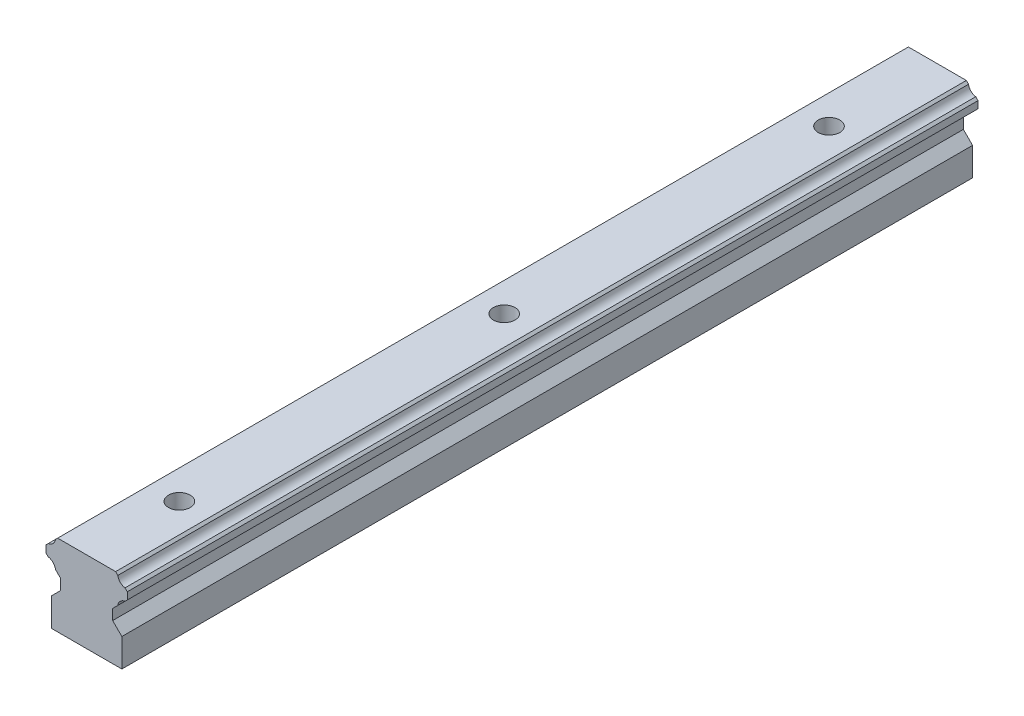
ISO-10303-21;
HEADER;
FILE_DESCRIPTION(('STEP AP214'),'2;1');
FILE_NAME('part.step','',(''),(''),'','','');
FILE_SCHEMA(('AUTOMOTIVE_DESIGN { 1 0 10303 214 1 1 1 1 }'));
ENDSEC;
DATA;
#1=APPLICATION_CONTEXT('core data for automotive mechanical design processes');
#2=APPLICATION_PROTOCOL_DEFINITION('international standard','automotive_design',2000,#1);
#3=PRODUCT_CONTEXT('',#1,'mechanical');
#4=PRODUCT('Part','Part','',(#3));
#5=PRODUCT_RELATED_PRODUCT_CATEGORY('part','',(#4));
#6=PRODUCT_DEFINITION_FORMATION('','',#4);
#7=PRODUCT_DEFINITION_CONTEXT('part definition',#1,'design');
#8=PRODUCT_DEFINITION('design','',#6,#7);
#9=PRODUCT_DEFINITION_SHAPE('','',#8);
#10=(LENGTH_UNIT() NAMED_UNIT(*) SI_UNIT(.MILLI.,.METRE.));
#11=(NAMED_UNIT(*) PLANE_ANGLE_UNIT() SI_UNIT($,.RADIAN.));
#12=(NAMED_UNIT(*) SI_UNIT($,.STERADIAN.) SOLID_ANGLE_UNIT());
#13=UNCERTAINTY_MEASURE_WITH_UNIT(LENGTH_MEASURE(1.E-05),#10,'distance_accuracy_value','');
#14=(GEOMETRIC_REPRESENTATION_CONTEXT(3) GLOBAL_UNCERTAINTY_ASSIGNED_CONTEXT((#13)) GLOBAL_UNIT_ASSIGNED_CONTEXT((#10,
#11,#12)) REPRESENTATION_CONTEXT('',''));
#15=CARTESIAN_POINT('',(0.,0.,0.));
#16=DIRECTION('',(0.,0.,1.));
#17=DIRECTION('',(1.,0.,0.));
#18=AXIS2_PLACEMENT_3D('',#15,#16,#17);
#19=CARTESIAN_POINT('',(-6.5,5.20000000000005,156.99994));
#20=DIRECTION('',(0.707106781186547,-0.707106781186547,0.));
#21=DIRECTION('',(0.707106781186548,0.707106781186548,0.));
#22=AXIS2_PLACEMENT_3D('',#19,#20,#21);
#23=PLANE('',#22);
#24=DIRECTION('',(-0.707106781186547,-0.707106781186547,0.));
#25=VECTOR('',#24,1.);
#26=CARTESIAN_POINT('',(-6.5,5.20000000000005,0.));
#27=LINE('',#26,#25);
#28=CARTESIAN_POINT('',(-4.8,6.90000000000005,0.));
#29=VERTEX_POINT('',#28);
#30=CARTESIAN_POINT('',(-6.5,5.20000000000005,0.));
#31=VERTEX_POINT('',#30);
#32=EDGE_CURVE('E214',#29,#31,#27,.T.);
#33=ORIENTED_EDGE('',*,*,#32,.T.);
#34=DIRECTION('',(0.,0.,-1.));
#35=VECTOR('',#34,1.);
#36=CARTESIAN_POINT('',(-6.5,5.20000000000005,156.99994));
#37=LINE('',#36,#35);
#38=CARTESIAN_POINT('',(-6.5,5.20000000000005,156.99994));
#39=VERTEX_POINT('',#38);
#40=EDGE_CURVE('E11',#39,#31,#37,.T.);
#41=ORIENTED_EDGE('',*,*,#40,.F.);
#42=DIRECTION('',(-0.707106781186547,-0.707106781186547,0.));
#43=VECTOR('',#42,1.);
#44=CARTESIAN_POINT('',(-6.5,5.20000000000005,156.99994));
#45=LINE('',#44,#43);
#46=CARTESIAN_POINT('',(-4.8,6.90000000000005,156.99994));
#47=VERTEX_POINT('',#46);
#48=EDGE_CURVE('E257',#47,#39,#45,.T.);
#49=ORIENTED_EDGE('',*,*,#48,.F.);
#50=DIRECTION('',(0.,0.,-1.));
#51=VECTOR('',#50,1.);
#52=CARTESIAN_POINT('',(-4.8,6.90000000000005,156.99994));
#53=LINE('',#52,#51);
#54=EDGE_CURVE('E210',#47,#29,#53,.T.);
#55=ORIENTED_EDGE('',*,*,#54,.T.);
#56=EDGE_LOOP('',(#33,#41,#49,#55));
#57=FACE_BOUND('',#56,.T.);
#58=ADVANCED_FACE('F34',(#57),#23,.F.);
#59=CARTESIAN_POINT('',(-6.5,5.20000000000005,156.99994));
#60=DIRECTION('',(1.,0.,0.));
#61=DIRECTION('',(0.,0.,-1.));
#62=AXIS2_PLACEMENT_3D('',#59,#60,#61);
#63=PLANE('',#62);
#64=DIRECTION('',(0.,-1.,0.));
#65=VECTOR('',#64,1.);
#66=CARTESIAN_POINT('',(-6.5,5.20000000000005,0.));
#67=LINE('',#66,#65);
#68=CARTESIAN_POINT('',(-6.5,0.,0.));
#69=VERTEX_POINT('',#68);
#70=EDGE_CURVE('E217',#31,#69,#67,.T.);
#71=ORIENTED_EDGE('',*,*,#70,.T.);
#72=DIRECTION('',(0.,0.,-1.));
#73=VECTOR('',#72,1.);
#74=CARTESIAN_POINT('',(-6.5,0.,156.99994));
#75=LINE('',#74,#73);
#76=CARTESIAN_POINT('',(-6.5,0.,156.99994));
#77=VERTEX_POINT('',#76);
#78=EDGE_CURVE('E42',#77,#69,#75,.T.);
#79=ORIENTED_EDGE('',*,*,#78,.F.);
#80=DIRECTION('',(0.,-1.,0.));
#81=VECTOR('',#80,1.);
#82=CARTESIAN_POINT('',(-6.5,5.20000000000005,156.99994));
#83=LINE('',#82,#81);
#84=EDGE_CURVE('E135',#39,#77,#83,.T.);
#85=ORIENTED_EDGE('',*,*,#84,.F.);
#86=ORIENTED_EDGE('',*,*,#40,.T.);
#87=EDGE_LOOP('',(#71,#79,#85,#86));
#88=FACE_BOUND('',#87,.T.);
#89=ADVANCED_FACE('F385',(#88),#63,.F.);
#90=CARTESIAN_POINT('',(-6.5,0.,156.99994));
#91=DIRECTION('',(0.,1.,0.));
#92=DIRECTION('',(0.,0.,1.));
#93=AXIS2_PLACEMENT_3D('',#90,#91,#92);
#94=PLANE('',#93);
#95=CARTESIAN_POINT('',(0.,0.,20.));
#96=DIRECTION('',(0.,1.,0.));
#97=DIRECTION('',(0.,0.,1.));
#98=AXIS2_PLACEMENT_3D('',#95,#96,#97);
#99=CIRCLE('',#98,2.);
#100=CARTESIAN_POINT('',(0.,0.,22.));
#101=VERTEX_POINT('',#100);
#102=EDGE_CURVE('E218',#101,#101,#99,.T.);
#103=ORIENTED_EDGE('',*,*,#102,.T.);
#104=EDGE_LOOP('',(#103));
#105=FACE_BOUND('',#104,.T.);
#106=CARTESIAN_POINT('',(0.,0.,79.944));
#107=DIRECTION('',(0.,1.,0.));
#108=DIRECTION('',(0.,0.,1.));
#109=AXIS2_PLACEMENT_3D('',#106,#107,#108);
#110=CIRCLE('',#109,2.);
#111=CARTESIAN_POINT('',(0.,0.,81.944));
#112=VERTEX_POINT('',#111);
#113=EDGE_CURVE('E533',#112,#112,#110,.T.);
#114=ORIENTED_EDGE('',*,*,#113,.T.);
#115=EDGE_LOOP('',(#114));
#116=FACE_BOUND('',#115,.T.);
#117=CARTESIAN_POINT('',(0.,0.,139.888));
#118=DIRECTION('',(0.,1.,0.));
#119=DIRECTION('',(0.,0.,1.));
#120=AXIS2_PLACEMENT_3D('',#117,#118,#119);
#121=CIRCLE('',#120,2.);
#122=CARTESIAN_POINT('',(0.,0.,141.888));
#123=VERTEX_POINT('',#122);
#124=EDGE_CURVE('E542',#123,#123,#121,.T.);
#125=ORIENTED_EDGE('',*,*,#124,.T.);
#126=EDGE_LOOP('',(#125));
#127=FACE_BOUND('',#126,.T.);
#128=DIRECTION('',(1.,0.,0.));
#129=VECTOR('',#128,1.);
#130=CARTESIAN_POINT('',(-6.5,0.,0.));
#131=LINE('',#130,#129);
#132=CARTESIAN_POINT('',(6.5,0.,0.));
#133=VERTEX_POINT('',#132);
#134=EDGE_CURVE('E220',#69,#133,#131,.T.);
#135=ORIENTED_EDGE('',*,*,#134,.T.);
#136=DIRECTION('',(0.,0.,-1.));
#137=VECTOR('',#136,1.);
#138=CARTESIAN_POINT('',(6.5,0.,156.99994));
#139=LINE('',#138,#137);
#140=CARTESIAN_POINT('',(6.5,0.,156.99994));
#141=VERTEX_POINT('',#140);
#142=EDGE_CURVE('E306',#141,#133,#139,.T.);
#143=ORIENTED_EDGE('',*,*,#142,.F.);
#144=DIRECTION('',(1.,0.,0.));
#145=VECTOR('',#144,1.);
#146=CARTESIAN_POINT('',(-6.5,0.,156.99994));
#147=LINE('',#146,#145);
#148=EDGE_CURVE('E314',#77,#141,#147,.T.);
#149=ORIENTED_EDGE('',*,*,#148,.F.);
#150=ORIENTED_EDGE('',*,*,#78,.T.);
#151=EDGE_LOOP('',(#135,#143,#149,#150));
#152=FACE_BOUND('',#151,.T.);
#153=ADVANCED_FACE('F312',(#105,#116,#127,#152),#94,.F.);
#154=CARTESIAN_POINT('',(6.5,5.20000000000005,156.99994));
#155=DIRECTION('',(-1.,0.,0.));
#156=DIRECTION('',(0.,0.,1.));
#157=AXIS2_PLACEMENT_3D('',#154,#155,#156);
#158=PLANE('',#157);
#159=DIRECTION('',(0.,1.,0.));
#160=VECTOR('',#159,1.);
#161=CARTESIAN_POINT('',(6.5,5.20000000000005,0.));
#162=LINE('',#161,#160);
#163=CARTESIAN_POINT('',(6.5,5.20000000000005,0.));
#164=VERTEX_POINT('',#163);
#165=EDGE_CURVE('E222',#133,#164,#162,.T.);
#166=ORIENTED_EDGE('',*,*,#165,.T.);
#167=DIRECTION('',(0.,0.,-1.));
#168=VECTOR('',#167,1.);
#169=CARTESIAN_POINT('',(6.5,5.20000000000005,156.99994));
#170=LINE('',#169,#168);
#171=CARTESIAN_POINT('',(6.5,5.20000000000005,156.99994));
#172=VERTEX_POINT('',#171);
#173=EDGE_CURVE('E303',#172,#164,#170,.T.);
#174=ORIENTED_EDGE('',*,*,#173,.F.);
#175=DIRECTION('',(0.,1.,0.));
#176=VECTOR('',#175,1.);
#177=CARTESIAN_POINT('',(6.5,5.20000000000005,156.99994));
#178=LINE('',#177,#176);
#179=EDGE_CURVE('E332',#141,#172,#178,.T.);
#180=ORIENTED_EDGE('',*,*,#179,.F.);
#181=ORIENTED_EDGE('',*,*,#142,.T.);
#182=EDGE_LOOP('',(#166,#174,#180,#181));
#183=FACE_BOUND('',#182,.T.);
#184=ADVANCED_FACE('F323',(#183),#158,.F.);
#185=CARTESIAN_POINT('',(4.8,6.90000000000005,156.99994));
#186=DIRECTION('',(-0.707106781186547,-0.707106781186547,0.));
#187=DIRECTION('',(0.707106781186548,-0.707106781186548,0.));
#188=AXIS2_PLACEMENT_3D('',#185,#186,#187);
#189=PLANE('',#188);
#190=DIRECTION('',(-0.707106781186547,0.707106781186547,0.));
#191=VECTOR('',#190,1.);
#192=CARTESIAN_POINT('',(4.8,6.90000000000005,0.));
#193=LINE('',#192,#191);
#194=CARTESIAN_POINT('',(4.8,6.90000000000005,0.));
#195=VERTEX_POINT('',#194);
#196=EDGE_CURVE('E224',#164,#195,#193,.T.);
#197=ORIENTED_EDGE('',*,*,#196,.T.);
#198=DIRECTION('',(0.,0.,-1.));
#199=VECTOR('',#198,1.);
#200=CARTESIAN_POINT('',(4.8,6.90000000000005,156.99994));
#201=LINE('',#200,#199);
#202=CARTESIAN_POINT('',(4.8,6.90000000000005,156.99994));
#203=VERTEX_POINT('',#202);
#204=EDGE_CURVE('E300',#203,#195,#201,.T.);
#205=ORIENTED_EDGE('',*,*,#204,.F.);
#206=DIRECTION('',(-0.707106781186547,0.707106781186547,0.));
#207=VECTOR('',#206,1.);
#208=CARTESIAN_POINT('',(4.8,6.90000000000005,156.99994));
#209=LINE('',#208,#207);
#210=EDGE_CURVE('E329',#172,#203,#209,.T.);
#211=ORIENTED_EDGE('',*,*,#210,.F.);
#212=ORIENTED_EDGE('',*,*,#173,.T.);
#213=EDGE_LOOP('',(#197,#205,#211,#212));
#214=FACE_BOUND('',#213,.T.);
#215=ADVANCED_FACE('F327',(#214),#189,.F.);
#216=CARTESIAN_POINT('',(4.8,8.84000000000005,156.99994));
#217=DIRECTION('',(-1.,0.,0.));
#218=DIRECTION('',(0.,0.,1.));
#219=AXIS2_PLACEMENT_3D('',#216,#217,#218);
#220=PLANE('',#219);
#221=DIRECTION('',(0.,1.,0.));
#222=VECTOR('',#221,1.);
#223=CARTESIAN_POINT('',(4.8,8.84000000000005,0.));
#224=LINE('',#223,#222);
#225=CARTESIAN_POINT('',(4.8,8.84000000000005,0.));
#226=VERTEX_POINT('',#225);
#227=EDGE_CURVE('E226',#195,#226,#224,.T.);
#228=ORIENTED_EDGE('',*,*,#227,.T.);
#229=DIRECTION('',(0.,0.,-1.));
#230=VECTOR('',#229,1.);
#231=CARTESIAN_POINT('',(4.8,8.84000000000005,156.99994));
#232=LINE('',#231,#230);
#233=CARTESIAN_POINT('',(4.8,8.84000000000005,156.99994));
#234=VERTEX_POINT('',#233);
#235=EDGE_CURVE('E297',#234,#226,#232,.T.);
#236=ORIENTED_EDGE('',*,*,#235,.F.);
#237=DIRECTION('',(0.,1.,0.));
#238=VECTOR('',#237,1.);
#239=CARTESIAN_POINT('',(4.8,8.84000000000005,156.99994));
#240=LINE('',#239,#238);
#241=EDGE_CURVE('E331',#203,#234,#240,.T.);
#242=ORIENTED_EDGE('',*,*,#241,.F.);
#243=ORIENTED_EDGE('',*,*,#204,.T.);
#244=EDGE_LOOP('',(#228,#236,#242,#243));
#245=FACE_BOUND('',#244,.T.);
#246=ADVANCED_FACE('F399',(#245),#220,.F.);
#247=CARTESIAN_POINT('',(5.7548684340674,9.79486843406745,156.99994));
#248=DIRECTION('',(-0.707106781186548,0.707106781186547,0.));
#249=DIRECTION('',(-0.707106781186547,-0.707106781186548,0.));
#250=AXIS2_PLACEMENT_3D('',#247,#248,#249);
#251=PLANE('',#250);
#252=DIRECTION('',(0.707106781186547,0.707106781186548,0.));
#253=VECTOR('',#252,1.);
#254=CARTESIAN_POINT('',(5.7548684340674,9.79486843406745,0.));
#255=LINE('',#254,#253);
#256=CARTESIAN_POINT('',(5.7548684340674,9.79486843406745,0.));
#257=VERTEX_POINT('',#256);
#258=EDGE_CURVE('E228',#226,#257,#255,.T.);
#259=ORIENTED_EDGE('',*,*,#258,.T.);
#260=DIRECTION('',(0.,0.,-1.));
#261=VECTOR('',#260,1.);
#262=CARTESIAN_POINT('',(5.7548684340674,9.79486843406745,156.99994));
#263=LINE('',#262,#261);
#264=CARTESIAN_POINT('',(5.7548684340674,9.79486843406745,156.99994));
#265=VERTEX_POINT('',#264);
#266=EDGE_CURVE('E294',#265,#257,#263,.T.);
#267=ORIENTED_EDGE('',*,*,#266,.F.);
#268=DIRECTION('',(0.707106781186547,0.707106781186548,0.));
#269=VECTOR('',#268,1.);
#270=CARTESIAN_POINT('',(5.7548684340674,9.79486843406745,156.99994));
#271=LINE('',#270,#269);
#272=EDGE_CURVE('E334',#234,#265,#271,.T.);
#273=ORIENTED_EDGE('',*,*,#272,.F.);
#274=ORIENTED_EDGE('',*,*,#235,.T.);
#275=EDGE_LOOP('',(#259,#267,#273,#274));
#276=FACE_BOUND('',#275,.T.);
#277=ADVANCED_FACE('F402',(#276),#251,.F.);
#278=CARTESIAN_POINT('',(7.29999999999997,9.58000000000008,156.99994));
#279=DIRECTION('',(0.,0.,-1.));
#280=DIRECTION('',(-1.,0.,0.));
#281=AXIS2_PLACEMENT_3D('',#278,#279,#280);
#282=CYLINDRICAL_SURFACE('',#281,1.55999999999993);
#283=CARTESIAN_POINT('',(7.29999999999997,9.58000000000008,0.));
#284=DIRECTION('',(0.,0.,-1.));
#285=DIRECTION('',(1.,0.,0.));
#286=AXIS2_PLACEMENT_3D('',#283,#284,#285);
#287=CIRCLE('',#286,1.55999999999993);
#288=CARTESIAN_POINT('',(7.0851315659326,11.1251315659326,0.));
#289=VERTEX_POINT('',#288);
#290=EDGE_CURVE('E230',#257,#289,#287,.T.);
#291=ORIENTED_EDGE('',*,*,#290,.T.);
#292=DIRECTION('',(0.,0.,-1.));
#293=VECTOR('',#292,1.);
#294=CARTESIAN_POINT('',(7.0851315659326,11.1251315659326,156.99994));
#295=LINE('',#294,#293);
#296=CARTESIAN_POINT('',(7.0851315659326,11.1251315659326,156.99994));
#297=VERTEX_POINT('',#296);
#298=EDGE_CURVE('E291',#297,#289,#295,.T.);
#299=ORIENTED_EDGE('',*,*,#298,.F.);
#300=CARTESIAN_POINT('',(7.29999999999997,9.58000000000008,156.99994));
#301=DIRECTION('',(0.,0.,-1.));
#302=DIRECTION('',(1.,0.,0.));
#303=AXIS2_PLACEMENT_3D('',#300,#301,#302);
#304=CIRCLE('',#303,1.55999999999993);
#305=EDGE_CURVE('E340',#265,#297,#304,.T.);
#306=ORIENTED_EDGE('',*,*,#305,.F.);
#307=ORIENTED_EDGE('',*,*,#266,.T.);
#308=EDGE_LOOP('',(#291,#299,#306,#307));
#309=FACE_BOUND('',#308,.T.);
#310=ADVANCED_FACE('F406',(#309),#282,.F.);
#311=CARTESIAN_POINT('',(7.5,11.54,156.99994));
#312=DIRECTION('',(-0.707106781186548,0.707106781186547,0.));
#313=DIRECTION('',(-0.707106781186547,-0.707106781186548,0.));
#314=AXIS2_PLACEMENT_3D('',#311,#312,#313);
#315=PLANE('',#314);
#316=DIRECTION('',(0.707106781186547,0.707106781186548,0.));
#317=VECTOR('',#316,1.);
#318=CARTESIAN_POINT('',(7.5,11.54,0.));
#319=LINE('',#318,#317);
#320=CARTESIAN_POINT('',(7.5,11.54,0.));
#321=VERTEX_POINT('',#320);
#322=EDGE_CURVE('E232',#289,#321,#319,.T.);
#323=ORIENTED_EDGE('',*,*,#322,.T.);
#324=DIRECTION('',(0.,0.,-1.));
#325=VECTOR('',#324,1.);
#326=CARTESIAN_POINT('',(7.5,11.54,156.99994));
#327=LINE('',#326,#325);
#328=CARTESIAN_POINT('',(7.5,11.54,156.99994));
#329=VERTEX_POINT('',#328);
#330=EDGE_CURVE('E288',#329,#321,#327,.T.);
#331=ORIENTED_EDGE('',*,*,#330,.F.);
#332=DIRECTION('',(0.707106781186547,0.707106781186548,0.));
#333=VECTOR('',#332,1.);
#334=CARTESIAN_POINT('',(7.5,11.54,156.99994));
#335=LINE('',#334,#333);
#336=EDGE_CURVE('E342',#297,#329,#335,.T.);
#337=ORIENTED_EDGE('',*,*,#336,.F.);
#338=ORIENTED_EDGE('',*,*,#298,.T.);
#339=EDGE_LOOP('',(#323,#331,#337,#338));
#340=FACE_BOUND('',#339,.T.);
#341=ADVANCED_FACE('F410',(#340),#315,.F.);
#342=CARTESIAN_POINT('',(7.5,12.85,156.99994));
#343=DIRECTION('',(-1.,0.,0.));
#344=DIRECTION('',(0.,0.,1.));
#345=AXIS2_PLACEMENT_3D('',#342,#343,#344);
#346=PLANE('',#345);
#347=DIRECTION('',(0.,1.,0.));
#348=VECTOR('',#347,1.);
#349=CARTESIAN_POINT('',(7.5,12.85,0.));
#350=LINE('',#349,#348);
#351=CARTESIAN_POINT('',(7.5,12.85,0.));
#352=VERTEX_POINT('',#351);
#353=EDGE_CURVE('E234',#321,#352,#350,.T.);
#354=ORIENTED_EDGE('',*,*,#353,.T.);
#355=DIRECTION('',(0.,0.,-1.));
#356=VECTOR('',#355,1.);
#357=CARTESIAN_POINT('',(7.5,12.85,156.99994));
#358=LINE('',#357,#356);
#359=CARTESIAN_POINT('',(7.5,12.85,156.99994));
#360=VERTEX_POINT('',#359);
#361=EDGE_CURVE('E285',#360,#352,#358,.T.);
#362=ORIENTED_EDGE('',*,*,#361,.F.);
#363=DIRECTION('',(0.,1.,0.));
#364=VECTOR('',#363,1.);
#365=CARTESIAN_POINT('',(7.5,12.85,156.99994));
#366=LINE('',#365,#364);
#367=EDGE_CURVE('E344',#329,#360,#366,.T.);
#368=ORIENTED_EDGE('',*,*,#367,.F.);
#369=ORIENTED_EDGE('',*,*,#330,.T.);
#370=EDGE_LOOP('',(#354,#362,#368,#369));
#371=FACE_BOUND('',#370,.T.);
#372=ADVANCED_FACE('F414',(#371),#346,.F.);
#373=CARTESIAN_POINT('',(7.0816423301223,13.2683576698777,156.99994));
#374=DIRECTION('',(-0.707106781186549,-0.707106781186546,0.));
#375=DIRECTION('',(0.707106781186546,-0.707106781186549,0.));
#376=AXIS2_PLACEMENT_3D('',#373,#374,#375);
#377=PLANE('',#376);
#378=DIRECTION('',(-0.707106781186546,0.707106781186549,0.));
#379=VECTOR('',#378,1.);
#380=CARTESIAN_POINT('',(7.0816423301223,13.2683576698777,0.));
#381=LINE('',#380,#379);
#382=CARTESIAN_POINT('',(7.0816423301223,13.2683576698777,0.));
#383=VERTEX_POINT('',#382);
#384=EDGE_CURVE('E236',#352,#383,#381,.T.);
#385=ORIENTED_EDGE('',*,*,#384,.T.);
#386=DIRECTION('',(0.,0.,-1.));
#387=VECTOR('',#386,1.);
#388=CARTESIAN_POINT('',(7.0816423301223,13.2683576698777,156.99994));
#389=LINE('',#388,#387);
#390=CARTESIAN_POINT('',(7.0816423301223,13.2683576698777,156.99994));
#391=VERTEX_POINT('',#390);
#392=EDGE_CURVE('E282',#391,#383,#389,.T.);
#393=ORIENTED_EDGE('',*,*,#392,.F.);
#394=DIRECTION('',(-0.707106781186546,0.707106781186549,0.));
#395=VECTOR('',#394,1.);
#396=CARTESIAN_POINT('',(7.0816423301223,13.2683576698777,156.99994));
#397=LINE('',#396,#395);
#398=EDGE_CURVE('E346',#360,#391,#397,.T.);
#399=ORIENTED_EDGE('',*,*,#398,.F.);
#400=ORIENTED_EDGE('',*,*,#361,.T.);
#401=EDGE_LOOP('',(#385,#393,#399,#400));
#402=FACE_BOUND('',#401,.T.);
#403=ADVANCED_FACE('F418',(#402),#377,.F.);
#404=CARTESIAN_POINT('',(7.30000000000014,14.8130000000002,156.99994));
#405=DIRECTION('',(0.,0.,-1.));
#406=DIRECTION('',(-1.,0.,0.));
#407=AXIS2_PLACEMENT_3D('',#404,#405,#406);
#408=CYLINDRICAL_SURFACE('',#407,1.56000000000018);
#409=CARTESIAN_POINT('',(7.30000000000014,14.8130000000002,0.));
#410=DIRECTION('',(0.,0.,-1.));
#411=DIRECTION('',(1.,0.,0.));
#412=AXIS2_PLACEMENT_3D('',#409,#410,#411);
#413=CIRCLE('',#412,1.56000000000018);
#414=CARTESIAN_POINT('',(5.7553576698777,14.5946423301223,0.));
#415=VERTEX_POINT('',#414);
#416=EDGE_CURVE('E238',#383,#415,#413,.T.);
#417=ORIENTED_EDGE('',*,*,#416,.T.);
#418=DIRECTION('',(0.,0.,-1.));
#419=VECTOR('',#418,1.);
#420=CARTESIAN_POINT('',(5.7553576698777,14.5946423301223,156.99994));
#421=LINE('',#420,#419);
#422=CARTESIAN_POINT('',(5.7553576698777,14.5946423301223,156.99994));
#423=VERTEX_POINT('',#422);
#424=EDGE_CURVE('E279',#423,#415,#421,.T.);
#425=ORIENTED_EDGE('',*,*,#424,.F.);
#426=CARTESIAN_POINT('',(7.30000000000014,14.8130000000002,156.99994));
#427=DIRECTION('',(0.,0.,-1.));
#428=DIRECTION('',(1.,0.,0.));
#429=AXIS2_PLACEMENT_3D('',#426,#427,#428);
#430=CIRCLE('',#429,1.56000000000018);
#431=EDGE_CURVE('E348',#391,#423,#430,.T.);
#432=ORIENTED_EDGE('',*,*,#431,.F.);
#433=ORIENTED_EDGE('',*,*,#392,.T.);
#434=EDGE_LOOP('',(#417,#425,#432,#433));
#435=FACE_BOUND('',#434,.T.);
#436=ADVANCED_FACE('F422',(#435),#408,.F.);
#437=CARTESIAN_POINT('',(5.35,15.,156.99994));
#438=DIRECTION('',(-0.707106781186549,-0.707106781186546,0.));
#439=DIRECTION('',(0.707106781186546,-0.707106781186549,0.));
#440=AXIS2_PLACEMENT_3D('',#437,#438,#439);
#441=PLANE('',#440);
#442=DIRECTION('',(-0.707106781186546,0.707106781186549,0.));
#443=VECTOR('',#442,1.);
#444=CARTESIAN_POINT('',(5.35,15.,0.));
#445=LINE('',#444,#443);
#446=CARTESIAN_POINT('',(5.35,15.,0.));
#447=VERTEX_POINT('',#446);
#448=EDGE_CURVE('E240',#415,#447,#445,.T.);
#449=ORIENTED_EDGE('',*,*,#448,.T.);
#450=DIRECTION('',(0.,0.,-1.));
#451=VECTOR('',#450,1.);
#452=CARTESIAN_POINT('',(5.35,15.,156.99994));
#453=LINE('',#452,#451);
#454=CARTESIAN_POINT('',(5.35,15.,156.99994));
#455=VERTEX_POINT('',#454);
#456=EDGE_CURVE('E276',#455,#447,#453,.T.);
#457=ORIENTED_EDGE('',*,*,#456,.F.);
#458=DIRECTION('',(-0.707106781186546,0.707106781186549,0.));
#459=VECTOR('',#458,1.);
#460=CARTESIAN_POINT('',(5.35,15.,156.99994));
#461=LINE('',#460,#459);
#462=EDGE_CURVE('E350',#423,#455,#461,.T.);
#463=ORIENTED_EDGE('',*,*,#462,.F.);
#464=ORIENTED_EDGE('',*,*,#424,.T.);
#465=EDGE_LOOP('',(#449,#457,#463,#464));
#466=FACE_BOUND('',#465,.T.);
#467=ADVANCED_FACE('F426',(#466),#441,.F.);
#468=CARTESIAN_POINT('',(-5.35,15.,156.99994));
#469=DIRECTION('',(0.,-1.,0.));
#470=DIRECTION('',(0.,0.,-1.));
#471=AXIS2_PLACEMENT_3D('',#468,#469,#470);
#472=PLANE('',#471);
#473=CARTESIAN_POINT('',(0.,15.,20.));
#474=DIRECTION('',(0.,1.,0.));
#475=DIRECTION('',(0.,0.,1.));
#476=AXIS2_PLACEMENT_3D('',#473,#474,#475);
#477=CIRCLE('',#476,2.);
#478=CARTESIAN_POINT('',(0.,15.,22.));
#479=VERTEX_POINT('',#478);
#480=EDGE_CURVE('E532',#479,#479,#477,.T.);
#481=ORIENTED_EDGE('',*,*,#480,.F.);
#482=EDGE_LOOP('',(#481));
#483=FACE_BOUND('',#482,.T.);
#484=CARTESIAN_POINT('',(0.,15.,79.944));
#485=DIRECTION('',(0.,1.,0.));
#486=DIRECTION('',(0.,0.,1.));
#487=AXIS2_PLACEMENT_3D('',#484,#485,#486);
#488=CIRCLE('',#487,2.);
#489=CARTESIAN_POINT('',(0.,15.,81.944));
#490=VERTEX_POINT('',#489);
#491=EDGE_CURVE('E537',#490,#490,#488,.T.);
#492=ORIENTED_EDGE('',*,*,#491,.F.);
#493=EDGE_LOOP('',(#492));
#494=FACE_BOUND('',#493,.T.);
#495=CARTESIAN_POINT('',(0.,15.,139.888));
#496=DIRECTION('',(0.,1.,0.));
#497=DIRECTION('',(0.,0.,1.));
#498=AXIS2_PLACEMENT_3D('',#495,#496,#497);
#499=CIRCLE('',#498,2.);
#500=CARTESIAN_POINT('',(0.,15.,141.888));
#501=VERTEX_POINT('',#500);
#502=EDGE_CURVE('E545',#501,#501,#499,.T.);
#503=ORIENTED_EDGE('',*,*,#502,.F.);
#504=EDGE_LOOP('',(#503));
#505=FACE_BOUND('',#504,.T.);
#506=DIRECTION('',(-1.,0.,0.));
#507=VECTOR('',#506,1.);
#508=CARTESIAN_POINT('',(-5.35,15.,0.));
#509=LINE('',#508,#507);
#510=CARTESIAN_POINT('',(-5.35,15.,0.));
#511=VERTEX_POINT('',#510);
#512=EDGE_CURVE('E242',#447,#511,#509,.T.);
#513=ORIENTED_EDGE('',*,*,#512,.T.);
#514=DIRECTION('',(0.,0.,-1.));
#515=VECTOR('',#514,1.);
#516=CARTESIAN_POINT('',(-5.35,15.,156.99994));
#517=LINE('',#516,#515);
#518=CARTESIAN_POINT('',(-5.35,15.,156.99994));
#519=VERTEX_POINT('',#518);
#520=EDGE_CURVE('E273',#519,#511,#517,.T.);
#521=ORIENTED_EDGE('',*,*,#520,.F.);
#522=DIRECTION('',(-1.,0.,0.));
#523=VECTOR('',#522,1.);
#524=CARTESIAN_POINT('',(-5.35,15.,156.99994));
#525=LINE('',#524,#523);
#526=EDGE_CURVE('E352',#455,#519,#525,.T.);
#527=ORIENTED_EDGE('',*,*,#526,.F.);
#528=ORIENTED_EDGE('',*,*,#456,.T.);
#529=EDGE_LOOP('',(#513,#521,#527,#528));
#530=FACE_BOUND('',#529,.T.);
#531=ADVANCED_FACE('F430',(#483,#494,#505,#530),#472,.F.);
#532=CARTESIAN_POINT('',(-5.7553576698777,14.5946423301223,156.99994));
#533=DIRECTION('',(0.707106781186547,-0.707106781186547,0.));
#534=DIRECTION('',(0.707106781186548,0.707106781186548,0.));
#535=AXIS2_PLACEMENT_3D('',#532,#533,#534);
#536=PLANE('',#535);
#537=DIRECTION('',(-0.707106781186547,-0.707106781186547,0.));
#538=VECTOR('',#537,1.);
#539=CARTESIAN_POINT('',(-5.7553576698777,14.5946423301223,0.));
#540=LINE('',#539,#538);
#541=CARTESIAN_POINT('',(-5.7553576698777,14.5946423301223,0.));
#542=VERTEX_POINT('',#541);
#543=EDGE_CURVE('E244',#511,#542,#540,.T.);
#544=ORIENTED_EDGE('',*,*,#543,.T.);
#545=DIRECTION('',(0.,0.,-1.));
#546=VECTOR('',#545,1.);
#547=CARTESIAN_POINT('',(-5.7553576698777,14.5946423301223,156.99994));
#548=LINE('',#547,#546);
#549=CARTESIAN_POINT('',(-5.7553576698777,14.5946423301223,156.99994));
#550=VERTEX_POINT('',#549);
#551=EDGE_CURVE('E270',#550,#542,#548,.T.);
#552=ORIENTED_EDGE('',*,*,#551,.F.);
#553=DIRECTION('',(-0.707106781186547,-0.707106781186547,0.));
#554=VECTOR('',#553,1.);
#555=CARTESIAN_POINT('',(-5.7553576698777,14.5946423301223,156.99994));
#556=LINE('',#555,#554);
#557=EDGE_CURVE('E354',#519,#550,#556,.T.);
#558=ORIENTED_EDGE('',*,*,#557,.F.);
#559=ORIENTED_EDGE('',*,*,#520,.T.);
#560=EDGE_LOOP('',(#544,#552,#558,#559));
#561=FACE_BOUND('',#560,.T.);
#562=ADVANCED_FACE('F434',(#561),#536,.F.);
#563=CARTESIAN_POINT('',(-7.30000000000015,14.8130000000002,156.99994));
#564=DIRECTION('',(0.,0.,-1.));
#565=DIRECTION('',(-1.,0.,0.));
#566=AXIS2_PLACEMENT_3D('',#563,#564,#565);
#567=CYLINDRICAL_SURFACE('',#566,1.56000000000019);
#568=CARTESIAN_POINT('',(-7.30000000000015,14.8130000000002,0.));
#569=DIRECTION('',(0.,0.,-1.));
#570=DIRECTION('',(1.,0.,0.));
#571=AXIS2_PLACEMENT_3D('',#568,#569,#570);
#572=CIRCLE('',#571,1.56000000000019);
#573=CARTESIAN_POINT('',(-7.0816423301223,13.2683576698777,0.));
#574=VERTEX_POINT('',#573);
#575=EDGE_CURVE('E246',#542,#574,#572,.T.);
#576=ORIENTED_EDGE('',*,*,#575,.T.);
#577=DIRECTION('',(0.,0.,-1.));
#578=VECTOR('',#577,1.);
#579=CARTESIAN_POINT('',(-7.0816423301223,13.2683576698777,156.99994));
#580=LINE('',#579,#578);
#581=CARTESIAN_POINT('',(-7.0816423301223,13.2683576698777,156.99994));
#582=VERTEX_POINT('',#581);
#583=EDGE_CURVE('E267',#582,#574,#580,.T.);
#584=ORIENTED_EDGE('',*,*,#583,.F.);
#585=CARTESIAN_POINT('',(-7.30000000000015,14.8130000000002,156.99994));
#586=DIRECTION('',(0.,0.,-1.));
#587=DIRECTION('',(1.,0.,0.));
#588=AXIS2_PLACEMENT_3D('',#585,#586,#587);
#589=CIRCLE('',#588,1.56000000000019);
#590=EDGE_CURVE('E356',#550,#582,#589,.T.);
#591=ORIENTED_EDGE('',*,*,#590,.F.);
#592=ORIENTED_EDGE('',*,*,#551,.T.);
#593=EDGE_LOOP('',(#576,#584,#591,#592));
#594=FACE_BOUND('',#593,.T.);
#595=ADVANCED_FACE('F438',(#594),#567,.F.);
#596=CARTESIAN_POINT('',(-7.5,12.85,156.99994));
#597=DIRECTION('',(0.707106781186549,-0.707106781186546,0.));
#598=DIRECTION('',(0.707106781186546,0.707106781186549,0.));
#599=AXIS2_PLACEMENT_3D('',#596,#597,#598);
#600=PLANE('',#599);
#601=DIRECTION('',(-0.707106781186546,-0.707106781186549,0.));
#602=VECTOR('',#601,1.);
#603=CARTESIAN_POINT('',(-7.5,12.85,0.));
#604=LINE('',#603,#602);
#605=CARTESIAN_POINT('',(-7.5,12.85,0.));
#606=VERTEX_POINT('',#605);
#607=EDGE_CURVE('E248',#574,#606,#604,.T.);
#608=ORIENTED_EDGE('',*,*,#607,.T.);
#609=DIRECTION('',(0.,0.,-1.));
#610=VECTOR('',#609,1.);
#611=CARTESIAN_POINT('',(-7.5,12.85,156.99994));
#612=LINE('',#611,#610);
#613=CARTESIAN_POINT('',(-7.5,12.85,156.99994));
#614=VERTEX_POINT('',#613);
#615=EDGE_CURVE('E264',#614,#606,#612,.T.);
#616=ORIENTED_EDGE('',*,*,#615,.F.);
#617=DIRECTION('',(-0.707106781186546,-0.707106781186549,0.));
#618=VECTOR('',#617,1.);
#619=CARTESIAN_POINT('',(-7.5,12.85,156.99994));
#620=LINE('',#619,#618);
#621=EDGE_CURVE('E358',#582,#614,#620,.T.);
#622=ORIENTED_EDGE('',*,*,#621,.F.);
#623=ORIENTED_EDGE('',*,*,#583,.T.);
#624=EDGE_LOOP('',(#608,#616,#622,#623));
#625=FACE_BOUND('',#624,.T.);
#626=ADVANCED_FACE('F442',(#625),#600,.F.);
#627=CARTESIAN_POINT('',(-7.5,11.54,156.99994));
#628=DIRECTION('',(1.,0.,0.));
#629=DIRECTION('',(0.,0.,-1.));
#630=AXIS2_PLACEMENT_3D('',#627,#628,#629);
#631=PLANE('',#630);
#632=DIRECTION('',(0.,-1.,0.));
#633=VECTOR('',#632,1.);
#634=CARTESIAN_POINT('',(-7.5,11.54,0.));
#635=LINE('',#634,#633);
#636=CARTESIAN_POINT('',(-7.5,11.54,0.));
#637=VERTEX_POINT('',#636);
#638=EDGE_CURVE('E250',#606,#637,#635,.T.);
#639=ORIENTED_EDGE('',*,*,#638,.T.);
#640=DIRECTION('',(0.,0.,-1.));
#641=VECTOR('',#640,1.);
#642=CARTESIAN_POINT('',(-7.5,11.54,156.99994));
#643=LINE('',#642,#641);
#644=CARTESIAN_POINT('',(-7.5,11.54,156.99994));
#645=VERTEX_POINT('',#644);
#646=EDGE_CURVE('E261',#645,#637,#643,.T.);
#647=ORIENTED_EDGE('',*,*,#646,.F.);
#648=DIRECTION('',(0.,-1.,0.));
#649=VECTOR('',#648,1.);
#650=CARTESIAN_POINT('',(-7.5,11.54,156.99994));
#651=LINE('',#650,#649);
#652=EDGE_CURVE('E360',#614,#645,#651,.T.);
#653=ORIENTED_EDGE('',*,*,#652,.F.);
#654=ORIENTED_EDGE('',*,*,#615,.T.);
#655=EDGE_LOOP('',(#639,#647,#653,#654));
#656=FACE_BOUND('',#655,.T.);
#657=ADVANCED_FACE('F366',(#656),#631,.F.);
#658=CARTESIAN_POINT('',(-7.0851315659326,11.1251315659326,156.99994));
#659=DIRECTION('',(0.707106781186548,0.707106781186547,0.));
#660=DIRECTION('',(-0.707106781186547,0.707106781186548,0.));
#661=AXIS2_PLACEMENT_3D('',#658,#659,#660);
#662=PLANE('',#661);
#663=DIRECTION('',(0.707106781186547,-0.707106781186548,0.));
#664=VECTOR('',#663,1.);
#665=CARTESIAN_POINT('',(-7.0851315659326,11.1251315659326,0.));
#666=LINE('',#665,#664);
#667=CARTESIAN_POINT('',(-7.0851315659326,11.1251315659326,0.));
#668=VERTEX_POINT('',#667);
#669=EDGE_CURVE('E252',#637,#668,#666,.T.);
#670=ORIENTED_EDGE('',*,*,#669,.T.);
#671=DIRECTION('',(0.,0.,-1.));
#672=VECTOR('',#671,1.);
#673=CARTESIAN_POINT('',(-7.0851315659326,11.1251315659326,156.99994));
#674=LINE('',#673,#672);
#675=CARTESIAN_POINT('',(-7.0851315659326,11.1251315659326,156.99994));
#676=VERTEX_POINT('',#675);
#677=EDGE_CURVE('E205',#676,#668,#674,.T.);
#678=ORIENTED_EDGE('',*,*,#677,.F.);
#679=DIRECTION('',(0.707106781186547,-0.707106781186548,0.));
#680=VECTOR('',#679,1.);
#681=CARTESIAN_POINT('',(-7.0851315659326,11.1251315659326,156.99994));
#682=LINE('',#681,#680);
#683=EDGE_CURVE('E196',#645,#676,#682,.T.);
#684=ORIENTED_EDGE('',*,*,#683,.F.);
#685=ORIENTED_EDGE('',*,*,#646,.T.);
#686=EDGE_LOOP('',(#670,#678,#684,#685));
#687=FACE_BOUND('',#686,.T.);
#688=ADVANCED_FACE('F370',(#687),#662,.F.);
#689=CARTESIAN_POINT('',(-7.29999999999997,9.58000000000008,156.99994));
#690=DIRECTION('',(0.,0.,-1.));
#691=DIRECTION('',(-1.,0.,0.));
#692=AXIS2_PLACEMENT_3D('',#689,#690,#691);
#693=CYLINDRICAL_SURFACE('',#692,1.55999999999994);
#694=CARTESIAN_POINT('',(-7.29999999999997,9.58000000000008,0.));
#695=DIRECTION('',(0.,0.,-1.));
#696=DIRECTION('',(1.,0.,0.));
#697=AXIS2_PLACEMENT_3D('',#694,#695,#696);
#698=CIRCLE('',#697,1.55999999999994);
#699=CARTESIAN_POINT('',(-5.7548684340674,9.79486843406745,0.));
#700=VERTEX_POINT('',#699);
#701=EDGE_CURVE('E204',#668,#700,#698,.T.);
#702=ORIENTED_EDGE('',*,*,#701,.T.);
#703=DIRECTION('',(0.,0.,-1.));
#704=VECTOR('',#703,1.);
#705=CARTESIAN_POINT('',(-5.7548684340674,9.79486843406745,156.99994));
#706=LINE('',#705,#704);
#707=CARTESIAN_POINT('',(-5.7548684340674,9.79486843406745,156.99994));
#708=VERTEX_POINT('',#707);
#709=EDGE_CURVE('E201',#708,#700,#706,.T.);
#710=ORIENTED_EDGE('',*,*,#709,.F.);
#711=CARTESIAN_POINT('',(-7.29999999999997,9.58000000000008,156.99994));
#712=DIRECTION('',(0.,0.,-1.));
#713=DIRECTION('',(1.,0.,0.));
#714=AXIS2_PLACEMENT_3D('',#711,#712,#713);
#715=CIRCLE('',#714,1.55999999999994);
#716=EDGE_CURVE('E190',#676,#708,#715,.T.);
#717=ORIENTED_EDGE('',*,*,#716,.F.);
#718=ORIENTED_EDGE('',*,*,#677,.T.);
#719=EDGE_LOOP('',(#702,#710,#717,#718));
#720=FACE_BOUND('',#719,.T.);
#721=ADVANCED_FACE('F202',(#720),#693,.F.);
#722=CARTESIAN_POINT('',(-4.8,8.84000000000005,156.99994));
#723=DIRECTION('',(0.707106781186548,0.707106781186547,0.));
#724=DIRECTION('',(-0.707106781186547,0.707106781186548,0.));
#725=AXIS2_PLACEMENT_3D('',#722,#723,#724);
#726=PLANE('',#725);
#727=DIRECTION('',(0.707106781186547,-0.707106781186548,0.));
#728=VECTOR('',#727,1.);
#729=CARTESIAN_POINT('',(-4.8,8.84000000000005,0.));
#730=LINE('',#729,#728);
#731=CARTESIAN_POINT('',(-4.8,8.84000000000005,0.));
#732=VERTEX_POINT('',#731);
#733=EDGE_CURVE('E121',#700,#732,#730,.T.);
#734=ORIENTED_EDGE('',*,*,#733,.T.);
#735=DIRECTION('',(0.,0.,-1.));
#736=VECTOR('',#735,1.);
#737=CARTESIAN_POINT('',(-4.8,8.84000000000005,156.99994));
#738=LINE('',#737,#736);
#739=CARTESIAN_POINT('',(-4.8,8.84000000000005,156.99994));
#740=VERTEX_POINT('',#739);
#741=EDGE_CURVE('E206',#740,#732,#738,.T.);
#742=ORIENTED_EDGE('',*,*,#741,.F.);
#743=DIRECTION('',(0.707106781186547,-0.707106781186548,0.));
#744=VECTOR('',#743,1.);
#745=CARTESIAN_POINT('',(-4.8,8.84000000000005,156.99994));
#746=LINE('',#745,#744);
#747=EDGE_CURVE('E194',#708,#740,#746,.T.);
#748=ORIENTED_EDGE('',*,*,#747,.F.);
#749=ORIENTED_EDGE('',*,*,#709,.T.);
#750=EDGE_LOOP('',(#734,#742,#748,#749));
#751=FACE_BOUND('',#750,.T.);
#752=ADVANCED_FACE('F208',(#751),#726,.F.);
#753=CARTESIAN_POINT('',(-4.8,6.90000000000005,156.99994));
#754=DIRECTION('',(1.,0.,0.));
#755=DIRECTION('',(0.,0.,-1.));
#756=AXIS2_PLACEMENT_3D('',#753,#754,#755);
#757=PLANE('',#756);
#758=DIRECTION('',(0.,-1.,0.));
#759=VECTOR('',#758,1.);
#760=CARTESIAN_POINT('',(-4.8,6.90000000000005,0.));
#761=LINE('',#760,#759);
#762=EDGE_CURVE('E127',#732,#29,#761,.T.);
#763=ORIENTED_EDGE('',*,*,#762,.T.);
#764=ORIENTED_EDGE('',*,*,#54,.F.);
#765=DIRECTION('',(0.,-1.,0.));
#766=VECTOR('',#765,1.);
#767=CARTESIAN_POINT('',(-4.8,6.90000000000005,156.99994));
#768=LINE('',#767,#766);
#769=EDGE_CURVE('E50',#740,#47,#768,.T.);
#770=ORIENTED_EDGE('',*,*,#769,.F.);
#771=ORIENTED_EDGE('',*,*,#741,.T.);
#772=EDGE_LOOP('',(#763,#764,#770,#771));
#773=FACE_BOUND('',#772,.T.);
#774=ADVANCED_FACE('F374',(#773),#757,.F.);
#775=CARTESIAN_POINT('',(-7.29999999999997,9.58000000000008,156.99994));
#776=DIRECTION('',(0.,0.,1.));
#777=DIRECTION('',(1.,0.,0.));
#778=AXIS2_PLACEMENT_3D('',#775,#776,#777);
#779=PLANE('',#778);
#780=ORIENTED_EDGE('',*,*,#48,.T.);
#781=ORIENTED_EDGE('',*,*,#84,.T.);
#782=ORIENTED_EDGE('',*,*,#148,.T.);
#783=ORIENTED_EDGE('',*,*,#179,.T.);
#784=ORIENTED_EDGE('',*,*,#210,.T.);
#785=ORIENTED_EDGE('',*,*,#241,.T.);
#786=ORIENTED_EDGE('',*,*,#272,.T.);
#787=ORIENTED_EDGE('',*,*,#305,.T.);
#788=ORIENTED_EDGE('',*,*,#336,.T.);
#789=ORIENTED_EDGE('',*,*,#367,.T.);
#790=ORIENTED_EDGE('',*,*,#398,.T.);
#791=ORIENTED_EDGE('',*,*,#431,.T.);
#792=ORIENTED_EDGE('',*,*,#462,.T.);
#793=ORIENTED_EDGE('',*,*,#526,.T.);
#794=ORIENTED_EDGE('',*,*,#557,.T.);
#795=ORIENTED_EDGE('',*,*,#590,.T.);
#796=ORIENTED_EDGE('',*,*,#621,.T.);
#797=ORIENTED_EDGE('',*,*,#652,.T.);
#798=ORIENTED_EDGE('',*,*,#683,.T.);
#799=ORIENTED_EDGE('',*,*,#716,.T.);
#800=ORIENTED_EDGE('',*,*,#747,.T.);
#801=ORIENTED_EDGE('',*,*,#769,.T.);
#802=EDGE_LOOP('',(#780,#781,#782,#783,#784,#785,#786,#787,#788,#789,#790,#791,#792,#793,#794,
#795,#796,#797,#798,#799,#800,#801));
#803=FACE_BOUND('',#802,.T.);
#804=ADVANCED_FACE('F192',(#803),#779,.T.);
#805=CARTESIAN_POINT('',(-7.29999999999997,9.58000000000008,0.));
#806=DIRECTION('',(0.,0.,1.));
#807=DIRECTION('',(1.,0.,0.));
#808=AXIS2_PLACEMENT_3D('',#805,#806,#807);
#809=PLANE('',#808);
#810=ORIENTED_EDGE('',*,*,#32,.F.);
#811=ORIENTED_EDGE('',*,*,#762,.F.);
#812=ORIENTED_EDGE('',*,*,#733,.F.);
#813=ORIENTED_EDGE('',*,*,#701,.F.);
#814=ORIENTED_EDGE('',*,*,#669,.F.);
#815=ORIENTED_EDGE('',*,*,#638,.F.);
#816=ORIENTED_EDGE('',*,*,#607,.F.);
#817=ORIENTED_EDGE('',*,*,#575,.F.);
#818=ORIENTED_EDGE('',*,*,#543,.F.);
#819=ORIENTED_EDGE('',*,*,#512,.F.);
#820=ORIENTED_EDGE('',*,*,#448,.F.);
#821=ORIENTED_EDGE('',*,*,#416,.F.);
#822=ORIENTED_EDGE('',*,*,#384,.F.);
#823=ORIENTED_EDGE('',*,*,#353,.F.);
#824=ORIENTED_EDGE('',*,*,#322,.F.);
#825=ORIENTED_EDGE('',*,*,#290,.F.);
#826=ORIENTED_EDGE('',*,*,#258,.F.);
#827=ORIENTED_EDGE('',*,*,#227,.F.);
#828=ORIENTED_EDGE('',*,*,#196,.F.);
#829=ORIENTED_EDGE('',*,*,#165,.F.);
#830=ORIENTED_EDGE('',*,*,#134,.F.);
#831=ORIENTED_EDGE('',*,*,#70,.F.);
#832=EDGE_LOOP('',(#810,#811,#812,#813,#814,#815,#816,#817,#818,#819,#820,#821,#822,#823,#824,
#825,#826,#827,#828,#829,#830,#831));
#833=FACE_BOUND('',#832,.T.);
#834=ADVANCED_FACE('F318',(#833),#809,.F.);
#835=CARTESIAN_POINT('',(0.,0.,139.888));
#836=DIRECTION('',(0.,1.,0.));
#837=DIRECTION('',(0.,0.,1.));
#838=AXIS2_PLACEMENT_3D('',#835,#836,#837);
#839=CYLINDRICAL_SURFACE('',#838,2.);
#840=ORIENTED_EDGE('',*,*,#124,.F.);
#841=EDGE_LOOP('',(#840));
#842=FACE_BOUND('',#841,.T.);
#843=ORIENTED_EDGE('',*,*,#502,.T.);
#844=EDGE_LOOP('',(#843));
#845=FACE_BOUND('',#844,.T.);
#846=ADVANCED_FACE('F479',(#842,#845),#839,.F.);
#847=CARTESIAN_POINT('',(0.,0.,79.944));
#848=DIRECTION('',(0.,1.,0.));
#849=DIRECTION('',(0.,0.,1.));
#850=AXIS2_PLACEMENT_3D('',#847,#848,#849);
#851=CYLINDRICAL_SURFACE('',#850,2.);
#852=ORIENTED_EDGE('',*,*,#113,.F.);
#853=EDGE_LOOP('',(#852));
#854=FACE_BOUND('',#853,.T.);
#855=ORIENTED_EDGE('',*,*,#491,.T.);
#856=EDGE_LOOP('',(#855));
#857=FACE_BOUND('',#856,.T.);
#858=ADVANCED_FACE('F503',(#854,#857),#851,.F.);
#859=CARTESIAN_POINT('',(0.,0.,20.));
#860=DIRECTION('',(0.,1.,0.));
#861=DIRECTION('',(0.,0.,1.));
#862=AXIS2_PLACEMENT_3D('',#859,#860,#861);
#863=CYLINDRICAL_SURFACE('',#862,2.);
#864=ORIENTED_EDGE('',*,*,#102,.F.);
#865=EDGE_LOOP('',(#864));
#866=FACE_BOUND('',#865,.T.);
#867=ORIENTED_EDGE('',*,*,#480,.T.);
#868=EDGE_LOOP('',(#867));
#869=FACE_BOUND('',#868,.T.);
#870=ADVANCED_FACE('F513',(#866,#869),#863,.F.);
#871=CLOSED_SHELL('',(#58,#89,#153,#184,#215,#246,#277,#310,#341,#372,#403,#436,#467,#531,#562,
#595,#626,#657,#688,#721,#752,#774,#804,#834,#846,#858,#870));
#872=MANIFOLD_SOLID_BREP('B2',#871);
#873=ADVANCED_BREP_SHAPE_REPRESENTATION('',(#18,#872),#14);
#874=SHAPE_DEFINITION_REPRESENTATION(#9,#873);
ENDSEC;
END-ISO-10303-21;
